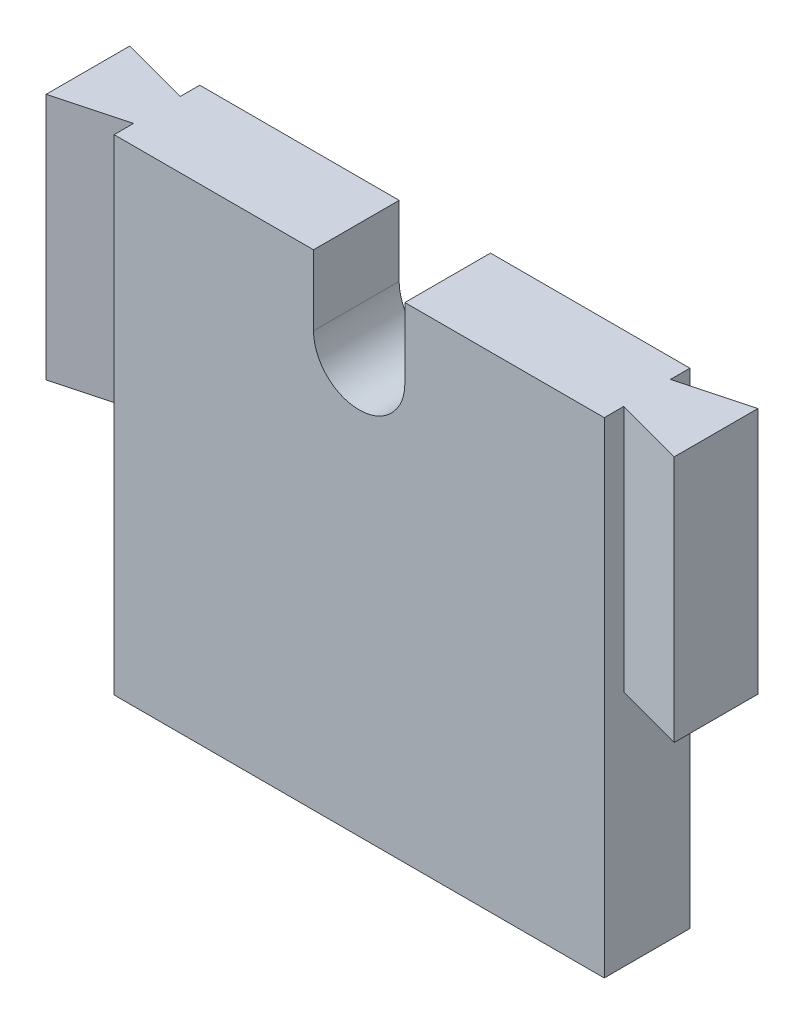
ISO-10303-21;
HEADER;
FILE_DESCRIPTION(('STEP AP214'),'2;1');
FILE_NAME('part.step','',(''),(''),'','','');
FILE_SCHEMA(('AUTOMOTIVE_DESIGN { 1 0 10303 214 1 1 1 1 }'));
ENDSEC;
DATA;
#1=APPLICATION_CONTEXT('core data for automotive mechanical design processes');
#2=APPLICATION_PROTOCOL_DEFINITION('international standard','automotive_design',2000,#1);
#3=PRODUCT_CONTEXT('',#1,'mechanical');
#4=PRODUCT('Part','Part','',(#3));
#5=PRODUCT_RELATED_PRODUCT_CATEGORY('part','',(#4));
#6=PRODUCT_DEFINITION_FORMATION('','',#4);
#7=PRODUCT_DEFINITION_CONTEXT('part definition',#1,'design');
#8=PRODUCT_DEFINITION('design','',#6,#7);
#9=PRODUCT_DEFINITION_SHAPE('','',#8);
#10=(LENGTH_UNIT() NAMED_UNIT(*) SI_UNIT(.MILLI.,.METRE.));
#11=(NAMED_UNIT(*) PLANE_ANGLE_UNIT() SI_UNIT($,.RADIAN.));
#12=(NAMED_UNIT(*) SI_UNIT($,.STERADIAN.) SOLID_ANGLE_UNIT());
#13=UNCERTAINTY_MEASURE_WITH_UNIT(LENGTH_MEASURE(1.E-05),#10,'distance_accuracy_value','');
#14=(GEOMETRIC_REPRESENTATION_CONTEXT(3) GLOBAL_UNCERTAINTY_ASSIGNED_CONTEXT((#13)) GLOBAL_UNIT_ASSIGNED_CONTEXT((#10,
#11,#12)) REPRESENTATION_CONTEXT('',''));
#15=CARTESIAN_POINT('',(0.,0.,0.));
#16=DIRECTION('',(0.,0.,1.));
#17=DIRECTION('',(1.,0.,0.));
#18=AXIS2_PLACEMENT_3D('',#15,#16,#17);
#19=CARTESIAN_POINT('',(-38.3529411764706,0.,9.));
#20=DIRECTION('',(1.,0.,0.));
#21=DIRECTION('',(0.,0.,-1.));
#22=AXIS2_PLACEMENT_3D('',#19,#20,#21);
#23=PLANE('',#22);
#24=DIRECTION('',(0.,0.,-1.));
#25=VECTOR('',#24,1.);
#26=CARTESIAN_POINT('',(-38.3529411764706,0.411764705882348,9.));
#27=LINE('',#26,#25);
#28=CARTESIAN_POINT('',(-38.3529411764706,0.411764705882348,8.89114283826888));
#29=VERTEX_POINT('',#28);
#30=CARTESIAN_POINT('',(-38.3529411764706,0.411764705882348,0.108857161731066));
#31=VERTEX_POINT('',#30);
#32=EDGE_CURVE('E302',#29,#31,#27,.T.);
#33=ORIENTED_EDGE('',*,*,#32,.F.);
#34=DIRECTION('',(0.,1.,0.));
#35=VECTOR('',#34,1.);
#36=CARTESIAN_POINT('',(-38.3529411764706,0.,8.89114283826888));
#37=LINE('',#36,#35);
#38=CARTESIAN_POINT('',(-38.3529411764706,26.4117647058823,8.89114283826888));
#39=VERTEX_POINT('',#38);
#40=EDGE_CURVE('E296',#29,#39,#37,.T.);
#41=ORIENTED_EDGE('',*,*,#40,.T.);
#42=DIRECTION('',(0.,0.,-1.));
#43=VECTOR('',#42,1.);
#44=CARTESIAN_POINT('',(-38.3529411764706,26.4117647058823,9.));
#45=LINE('',#44,#43);
#46=CARTESIAN_POINT('',(-38.3529411764706,26.4117647058823,0.108857161731066));
#47=VERTEX_POINT('',#46);
#48=EDGE_CURVE('E254',#39,#47,#45,.T.);
#49=ORIENTED_EDGE('',*,*,#48,.T.);
#50=DIRECTION('',(0.,-1.,0.));
#51=VECTOR('',#50,1.);
#52=CARTESIAN_POINT('',(-38.3529411764706,0.,0.108857161731066));
#53=LINE('',#52,#51);
#54=EDGE_CURVE('E53',#47,#31,#53,.T.);
#55=ORIENTED_EDGE('',*,*,#54,.T.);
#56=EDGE_LOOP('',(#33,#41,#49,#55));
#57=FACE_BOUND('',#56,.T.);
#58=ADVANCED_FACE('F44',(#57),#23,.F.);
#59=CARTESIAN_POINT('',(-38.7592016348187,-24.5882352941177,0.));
#60=DIRECTION('',(-0.258819045102525,0.,0.965925826289067));
#61=DIRECTION('',(0.965925826289067,0.,0.258819045102525));
#62=AXIS2_PLACEMENT_3D('',#59,#60,#61);
#63=PLANE('',#62);
#64=DIRECTION('',(0.965925826289067,0.,0.258819045102525));
#65=VECTOR('',#64,1.);
#66=CARTESIAN_POINT('',(-38.7592016348187,0.411764705882348,0.));
#67=LINE('',#66,#65);
#68=CARTESIAN_POINT('',(-31.1084974793026,0.411764705882348,2.05));
#69=VERTEX_POINT('',#68);
#70=EDGE_CURVE('E311',#31,#69,#67,.T.);
#71=ORIENTED_EDGE('',*,*,#70,.F.);
#72=ORIENTED_EDGE('',*,*,#54,.F.);
#73=DIRECTION('',(0.965925826289067,0.,0.258819045102525));
#74=VECTOR('',#73,1.);
#75=CARTESIAN_POINT('',(-38.7592016348187,26.4117647058823,0.));
#76=LINE('',#75,#74);
#77=CARTESIAN_POINT('',(-31.1084974793026,26.4117647058823,2.05));
#78=VERTEX_POINT('',#77);
#79=EDGE_CURVE('E184',#47,#78,#76,.T.);
#80=ORIENTED_EDGE('',*,*,#79,.T.);
#81=DIRECTION('',(0.,1.,0.));
#82=VECTOR('',#81,1.);
#83=CARTESIAN_POINT('',(-31.1084974793026,-24.5882352941177,2.05));
#84=LINE('',#83,#82);
#85=EDGE_CURVE('E195',#69,#78,#84,.T.);
#86=ORIENTED_EDGE('',*,*,#85,.F.);
#87=EDGE_LOOP('',(#71,#72,#80,#86));
#88=FACE_BOUND('',#87,.T.);
#89=ADVANCED_FACE('F308',(#88),#63,.F.);
#90=CARTESIAN_POINT('',(-38.7592016348189,-24.5882352941177,9.));
#91=DIRECTION('',(-0.258819045102518,0.,-0.965925826289069));
#92=DIRECTION('',(-0.965925826289069,0.,0.258819045102518));
#93=AXIS2_PLACEMENT_3D('',#90,#91,#92);
#94=PLANE('',#93);
#95=DIRECTION('',(-0.965925826289069,0.,0.258819045102518));
#96=VECTOR('',#95,1.);
#97=CARTESIAN_POINT('',(-38.7592016348189,0.411764705882348,9.));
#98=LINE('',#97,#96);
#99=CARTESIAN_POINT('',(-31.1084974793026,0.411764705882348,6.95));
#100=VERTEX_POINT('',#99);
#101=EDGE_CURVE('E329',#100,#29,#98,.T.);
#102=ORIENTED_EDGE('',*,*,#101,.F.);
#103=DIRECTION('',(0.,1.,0.));
#104=VECTOR('',#103,1.);
#105=CARTESIAN_POINT('',(-31.1084974793026,-24.5882352941177,6.95));
#106=LINE('',#105,#104);
#107=CARTESIAN_POINT('',(-31.1084974793026,26.4117647058823,6.95));
#108=VERTEX_POINT('',#107);
#109=EDGE_CURVE('E320',#100,#108,#106,.T.);
#110=ORIENTED_EDGE('',*,*,#109,.T.);
#111=DIRECTION('',(-0.965925826289069,0.,0.258819045102518));
#112=VECTOR('',#111,1.);
#113=CARTESIAN_POINT('',(-38.7592016348189,26.4117647058823,9.));
#114=LINE('',#113,#112);
#115=EDGE_CURVE('E339',#108,#39,#114,.T.);
#116=ORIENTED_EDGE('',*,*,#115,.T.);
#117=ORIENTED_EDGE('',*,*,#40,.F.);
#118=EDGE_LOOP('',(#102,#110,#116,#117));
#119=FACE_BOUND('',#118,.T.);
#120=ADVANCED_FACE('F397',(#119),#94,.F.);
#121=CARTESIAN_POINT('',(0.,-24.5882352941177,9.));
#122=DIRECTION('',(0.,1.,0.));
#123=DIRECTION('',(-1.,0.,0.));
#124=AXIS2_PLACEMENT_3D('',#121,#122,#123);
#125=PLANE('',#124);
#126=DIRECTION('',(1.,0.,0.));
#127=VECTOR('',#126,1.);
#128=CARTESIAN_POINT('',(0.,-24.5882352941177,9.));
#129=LINE('',#128,#127);
#130=CARTESIAN_POINT('',(-31.1084974793026,-24.5882352941177,9.));
#131=VERTEX_POINT('',#130);
#132=CARTESIAN_POINT('',(20.4026151263614,-24.5882352941177,9.));
#133=VERTEX_POINT('',#132);
#134=EDGE_CURVE('E230',#131,#133,#129,.T.);
#135=ORIENTED_EDGE('',*,*,#134,.F.);
#136=DIRECTION('',(0.,0.,-1.));
#137=VECTOR('',#136,1.);
#138=CARTESIAN_POINT('',(-31.1084974793026,-24.5882352941177,2.05));
#139=LINE('',#138,#137);
#140=CARTESIAN_POINT('',(-31.1084974793026,-24.5882352941177,0.));
#141=VERTEX_POINT('',#140);
#142=EDGE_CURVE('E198',#131,#141,#139,.T.);
#143=ORIENTED_EDGE('',*,*,#142,.T.);
#144=DIRECTION('',(1.,0.,0.));
#145=VECTOR('',#144,1.);
#146=CARTESIAN_POINT('',(0.,-24.5882352941177,0.));
#147=LINE('',#146,#145);
#148=CARTESIAN_POINT('',(20.4026151263614,-24.5882352941176,0.));
#149=VERTEX_POINT('',#148);
#150=EDGE_CURVE('E229',#141,#149,#147,.T.);
#151=ORIENTED_EDGE('',*,*,#150,.T.);
#152=DIRECTION('',(0.,0.,1.));
#153=VECTOR('',#152,1.);
#154=CARTESIAN_POINT('',(20.4026151263614,-24.5882352941177,6.95));
#155=LINE('',#154,#153);
#156=EDGE_CURVE('E176',#149,#133,#155,.T.);
#157=ORIENTED_EDGE('',*,*,#156,.T.);
#158=EDGE_LOOP('',(#135,#143,#151,#157));
#159=FACE_BOUND('',#158,.T.);
#160=ADVANCED_FACE('F46',(#159),#125,.F.);
#161=CARTESIAN_POINT('',(27.6470588235294,0.,9.));
#162=DIRECTION('',(1.,0.,0.));
#163=DIRECTION('',(0.,1.,0.));
#164=AXIS2_PLACEMENT_3D('',#161,#162,#163);
#165=PLANE('',#164);
#166=DIRECTION('',(0.,0.,1.));
#167=VECTOR('',#166,1.);
#168=CARTESIAN_POINT('',(27.6470588235294,0.411764705882355,9.));
#169=LINE('',#168,#167);
#170=CARTESIAN_POINT('',(27.6470588235294,0.411764705882355,0.108857161731061));
#171=VERTEX_POINT('',#170);
#172=CARTESIAN_POINT('',(27.6470588235294,0.411764705882355,8.89114283826888));
#173=VERTEX_POINT('',#172);
#174=EDGE_CURVE('E68',#171,#173,#169,.T.);
#175=ORIENTED_EDGE('',*,*,#174,.F.);
#176=DIRECTION('',(0.,-1.,0.));
#177=VECTOR('',#176,1.);
#178=CARTESIAN_POINT('',(27.6470588235294,0.,0.108857161731063));
#179=LINE('',#178,#177);
#180=CARTESIAN_POINT('',(27.6470588235294,26.4117647058823,0.108857161731062));
#181=VERTEX_POINT('',#180);
#182=EDGE_CURVE('E220',#181,#171,#179,.T.);
#183=ORIENTED_EDGE('',*,*,#182,.F.);
#184=DIRECTION('',(0.,0.,-1.));
#185=VECTOR('',#184,1.);
#186=CARTESIAN_POINT('',(27.6470588235294,26.4117647058824,9.));
#187=LINE('',#186,#185);
#188=CARTESIAN_POINT('',(27.6470588235294,26.4117647058823,8.89114283826888));
#189=VERTEX_POINT('',#188);
#190=EDGE_CURVE('E292',#189,#181,#187,.T.);
#191=ORIENTED_EDGE('',*,*,#190,.F.);
#192=DIRECTION('',(0.,1.,0.));
#193=VECTOR('',#192,1.);
#194=CARTESIAN_POINT('',(27.6470588235294,0.,8.89114283826888));
#195=LINE('',#194,#193);
#196=EDGE_CURVE('E226',#173,#189,#195,.T.);
#197=ORIENTED_EDGE('',*,*,#196,.F.);
#198=EDGE_LOOP('',(#175,#183,#191,#197));
#199=FACE_BOUND('',#198,.T.);
#200=ADVANCED_FACE('F378',(#199),#165,.T.);
#201=CARTESIAN_POINT('',(0.,26.4117647058823,9.));
#202=DIRECTION('',(0.,1.,0.));
#203=DIRECTION('',(-1.,0.,0.));
#204=AXIS2_PLACEMENT_3D('',#201,#202,#203);
#205=PLANE('',#204);
#206=DIRECTION('',(0.,0.,1.));
#207=VECTOR('',#206,1.);
#208=CARTESIAN_POINT('',(20.4026151263614,26.4117647058823,6.95));
#209=LINE('',#208,#207);
#210=CARTESIAN_POINT('',(20.4026151263614,26.4117647058823,6.95));
#211=VERTEX_POINT('',#210);
#212=CARTESIAN_POINT('',(20.4026151263614,26.4117647058824,9.));
#213=VERTEX_POINT('',#212);
#214=EDGE_CURVE('E182',#211,#213,#209,.T.);
#215=ORIENTED_EDGE('',*,*,#214,.F.);
#216=DIRECTION('',(-0.965925826289069,0.,-0.258819045102518));
#217=VECTOR('',#216,1.);
#218=CARTESIAN_POINT('',(28.0533192818777,26.4117647058823,9.));
#219=LINE('',#218,#217);
#220=EDGE_CURVE('E173',#189,#211,#219,.T.);
#221=ORIENTED_EDGE('',*,*,#220,.F.);
#222=ORIENTED_EDGE('',*,*,#190,.T.);
#223=DIRECTION('',(0.965925826289067,0.,-0.258819045102525));
#224=VECTOR('',#223,1.);
#225=CARTESIAN_POINT('',(28.0533192818775,26.4117647058823,0.));
#226=LINE('',#225,#224);
#227=CARTESIAN_POINT('',(20.4026151263614,26.4117647058823,2.05));
#228=VERTEX_POINT('',#227);
#229=EDGE_CURVE('E214',#228,#181,#226,.T.);
#230=ORIENTED_EDGE('',*,*,#229,.F.);
#231=DIRECTION('',(0.,0.,1.));
#232=VECTOR('',#231,1.);
#233=CARTESIAN_POINT('',(20.4026151263614,26.4117647058823,2.05));
#234=LINE('',#233,#232);
#235=CARTESIAN_POINT('',(20.4026151263614,26.4117647058823,0.));
#236=VERTEX_POINT('',#235);
#237=EDGE_CURVE('E193',#236,#228,#234,.T.);
#238=ORIENTED_EDGE('',*,*,#237,.F.);
#239=DIRECTION('',(1.,0.,0.));
#240=VECTOR('',#239,1.);
#241=CARTESIAN_POINT('',(0.,26.4117647058823,0.));
#242=LINE('',#241,#240);
#243=CARTESIAN_POINT('',(-0.552941176470589,26.4117647058823,0.));
#244=VERTEX_POINT('',#243);
#245=EDGE_CURVE('E258',#244,#236,#242,.T.);
#246=ORIENTED_EDGE('',*,*,#245,.F.);
#247=DIRECTION('',(0.,0.,-1.));
#248=VECTOR('',#247,1.);
#249=CARTESIAN_POINT('',(-0.552941176470589,26.4117647058823,9.));
#250=LINE('',#249,#248);
#251=CARTESIAN_POINT('',(-0.552941176470589,26.4117647058823,9.));
#252=VERTEX_POINT('',#251);
#253=EDGE_CURVE('E289',#252,#244,#250,.T.);
#254=ORIENTED_EDGE('',*,*,#253,.F.);
#255=DIRECTION('',(1.,0.,0.));
#256=VECTOR('',#255,1.);
#257=CARTESIAN_POINT('',(0.,26.4117647058823,9.));
#258=LINE('',#257,#256);
#259=EDGE_CURVE('E234',#252,#213,#258,.T.);
#260=ORIENTED_EDGE('',*,*,#259,.T.);
#261=EDGE_LOOP('',(#215,#221,#222,#230,#238,#246,#254,#260));
#262=FACE_BOUND('',#261,.T.);
#263=ADVANCED_FACE('F371',(#262),#205,.T.);
#264=CARTESIAN_POINT('',(-0.552941176470589,0.,9.));
#265=DIRECTION('',(-1.,0.,0.));
#266=DIRECTION('',(0.,0.,1.));
#267=AXIS2_PLACEMENT_3D('',#264,#265,#266);
#268=PLANE('',#267);
#269=DIRECTION('',(0.,1.,0.));
#270=VECTOR('',#269,1.);
#271=CARTESIAN_POINT('',(-0.552941176470589,0.,0.));
#272=LINE('',#271,#270);
#273=CARTESIAN_POINT('',(-0.552941176470589,19.0367647058823,0.));
#274=VERTEX_POINT('',#273);
#275=EDGE_CURVE('E262',#274,#244,#272,.T.);
#276=ORIENTED_EDGE('',*,*,#275,.F.);
#277=DIRECTION('',(0.,0.,-1.));
#278=VECTOR('',#277,1.);
#279=CARTESIAN_POINT('',(-0.552941176470589,19.0367647058823,9.));
#280=LINE('',#279,#278);
#281=CARTESIAN_POINT('',(-0.552941176470589,19.0367647058823,9.));
#282=VERTEX_POINT('',#281);
#283=EDGE_CURVE('E286',#282,#274,#280,.T.);
#284=ORIENTED_EDGE('',*,*,#283,.F.);
#285=DIRECTION('',(0.,1.,0.));
#286=VECTOR('',#285,1.);
#287=CARTESIAN_POINT('',(-0.552941176470589,0.,9.));
#288=LINE('',#287,#286);
#289=EDGE_CURVE('E239',#282,#252,#288,.T.);
#290=ORIENTED_EDGE('',*,*,#289,.T.);
#291=ORIENTED_EDGE('',*,*,#253,.T.);
#292=EDGE_LOOP('',(#276,#284,#290,#291));
#293=FACE_BOUND('',#292,.T.);
#294=ADVANCED_FACE('F366',(#293),#268,.T.);
#295=CARTESIAN_POINT('',(-5.35294117647059,19.0367647058823,9.));
#296=DIRECTION('',(0.,0.,-1.));
#297=DIRECTION('',(-1.,0.,0.));
#298=AXIS2_PLACEMENT_3D('',#295,#296,#297);
#299=CYLINDRICAL_SURFACE('',#298,4.8);
#300=CARTESIAN_POINT('',(-5.35294117647059,19.0367647058823,0.));
#301=DIRECTION('',(0.,0.,1.));
#302=DIRECTION('',(1.,0.,0.));
#303=AXIS2_PLACEMENT_3D('',#300,#301,#302);
#304=CIRCLE('',#303,4.8);
#305=CARTESIAN_POINT('',(-10.1529411764706,19.0367647058823,0.));
#306=VERTEX_POINT('',#305);
#307=EDGE_CURVE('E266',#306,#274,#304,.T.);
#308=ORIENTED_EDGE('',*,*,#307,.F.);
#309=DIRECTION('',(0.,0.,-1.));
#310=VECTOR('',#309,1.);
#311=CARTESIAN_POINT('',(-10.1529411764706,19.0367647058823,9.));
#312=LINE('',#311,#310);
#313=CARTESIAN_POINT('',(-10.1529411764706,19.0367647058823,9.));
#314=VERTEX_POINT('',#313);
#315=EDGE_CURVE('E283',#314,#306,#312,.T.);
#316=ORIENTED_EDGE('',*,*,#315,.F.);
#317=CARTESIAN_POINT('',(-5.35294117647059,19.0367647058823,9.));
#318=DIRECTION('',(0.,0.,1.));
#319=DIRECTION('',(1.,0.,0.));
#320=AXIS2_PLACEMENT_3D('',#317,#318,#319);
#321=CIRCLE('',#320,4.8);
#322=EDGE_CURVE('E243',#314,#282,#321,.T.);
#323=ORIENTED_EDGE('',*,*,#322,.T.);
#324=ORIENTED_EDGE('',*,*,#283,.T.);
#325=EDGE_LOOP('',(#308,#316,#323,#324));
#326=FACE_BOUND('',#325,.T.);
#327=ADVANCED_FACE('F363',(#326),#299,.F.);
#328=CARTESIAN_POINT('',(-10.1529411764706,0.,9.));
#329=DIRECTION('',(-1.,0.,0.));
#330=DIRECTION('',(0.,-1.,0.));
#331=AXIS2_PLACEMENT_3D('',#328,#329,#330);
#332=PLANE('',#331);
#333=DIRECTION('',(0.,1.,0.));
#334=VECTOR('',#333,1.);
#335=CARTESIAN_POINT('',(-10.1529411764706,0.,0.));
#336=LINE('',#335,#334);
#337=CARTESIAN_POINT('',(-10.1529411764706,26.4117647058823,0.));
#338=VERTEX_POINT('',#337);
#339=EDGE_CURVE('E270',#306,#338,#336,.T.);
#340=ORIENTED_EDGE('',*,*,#339,.T.);
#341=DIRECTION('',(0.,0.,-1.));
#342=VECTOR('',#341,1.);
#343=CARTESIAN_POINT('',(-10.1529411764706,26.4117647058823,9.));
#344=LINE('',#343,#342);
#345=CARTESIAN_POINT('',(-10.1529411764706,26.4117647058823,9.));
#346=VERTEX_POINT('',#345);
#347=EDGE_CURVE('E279',#346,#338,#344,.T.);
#348=ORIENTED_EDGE('',*,*,#347,.F.);
#349=DIRECTION('',(0.,1.,0.));
#350=VECTOR('',#349,1.);
#351=CARTESIAN_POINT('',(-10.1529411764706,0.,9.));
#352=LINE('',#351,#350);
#353=EDGE_CURVE('E247',#314,#346,#352,.T.);
#354=ORIENTED_EDGE('',*,*,#353,.F.);
#355=ORIENTED_EDGE('',*,*,#315,.T.);
#356=EDGE_LOOP('',(#340,#348,#354,#355));
#357=FACE_BOUND('',#356,.T.);
#358=ADVANCED_FACE('F356',(#357),#332,.F.);
#359=CARTESIAN_POINT('',(0.,26.4117647058823,9.));
#360=DIRECTION('',(0.,1.,0.));
#361=DIRECTION('',(-1.,0.,0.));
#362=AXIS2_PLACEMENT_3D('',#359,#360,#361);
#363=PLANE('',#362);
#364=DIRECTION('',(0.,0.,-1.));
#365=VECTOR('',#364,1.);
#366=CARTESIAN_POINT('',(-31.1084974793026,26.4117647058823,2.05));
#367=LINE('',#366,#365);
#368=CARTESIAN_POINT('',(-31.1084974793026,26.4117647058823,0.));
#369=VERTEX_POINT('',#368);
#370=EDGE_CURVE('E202',#78,#369,#367,.T.);
#371=ORIENTED_EDGE('',*,*,#370,.F.);
#372=ORIENTED_EDGE('',*,*,#79,.F.);
#373=ORIENTED_EDGE('',*,*,#48,.F.);
#374=ORIENTED_EDGE('',*,*,#115,.F.);
#375=DIRECTION('',(0.,0.,-1.));
#376=VECTOR('',#375,1.);
#377=CARTESIAN_POINT('',(-31.1084974793026,26.4117647058823,6.95));
#378=LINE('',#377,#376);
#379=CARTESIAN_POINT('',(-31.1084974793026,26.4117647058823,9.));
#380=VERTEX_POINT('',#379);
#381=EDGE_CURVE('E187',#380,#108,#378,.T.);
#382=ORIENTED_EDGE('',*,*,#381,.F.);
#383=DIRECTION('',(1.,0.,0.));
#384=VECTOR('',#383,1.);
#385=CARTESIAN_POINT('',(0.,26.4117647058823,9.));
#386=LINE('',#385,#384);
#387=EDGE_CURVE('E251',#380,#346,#386,.T.);
#388=ORIENTED_EDGE('',*,*,#387,.T.);
#389=ORIENTED_EDGE('',*,*,#347,.T.);
#390=DIRECTION('',(1.,0.,0.));
#391=VECTOR('',#390,1.);
#392=CARTESIAN_POINT('',(0.,26.4117647058823,0.));
#393=LINE('',#392,#391);
#394=EDGE_CURVE('E235',#369,#338,#393,.T.);
#395=ORIENTED_EDGE('',*,*,#394,.F.);
#396=EDGE_LOOP('',(#371,#372,#373,#374,#382,#388,#389,#395));
#397=FACE_BOUND('',#396,.T.);
#398=ADVANCED_FACE('F313',(#397),#363,.T.);
#399=CARTESIAN_POINT('',(0.,0.,9.));
#400=DIRECTION('',(0.,0.,1.));
#401=DIRECTION('',(1.,0.,0.));
#402=AXIS2_PLACEMENT_3D('',#399,#400,#401);
#403=PLANE('',#402);
#404=DIRECTION('',(0.,1.,0.));
#405=VECTOR('',#404,1.);
#406=CARTESIAN_POINT('',(20.4026151263614,-24.5882352941177,9.));
#407=LINE('',#406,#405);
#408=EDGE_CURVE('E177',#133,#213,#407,.T.);
#409=ORIENTED_EDGE('',*,*,#408,.T.);
#410=ORIENTED_EDGE('',*,*,#259,.F.);
#411=ORIENTED_EDGE('',*,*,#289,.F.);
#412=ORIENTED_EDGE('',*,*,#322,.F.);
#413=ORIENTED_EDGE('',*,*,#353,.T.);
#414=ORIENTED_EDGE('',*,*,#387,.F.);
#415=DIRECTION('',(0.,1.,0.));
#416=VECTOR('',#415,1.);
#417=CARTESIAN_POINT('',(-31.1084974793026,-24.5882352941177,9.));
#418=LINE('',#417,#416);
#419=EDGE_CURVE('E336',#131,#380,#418,.T.);
#420=ORIENTED_EDGE('',*,*,#419,.F.);
#421=ORIENTED_EDGE('',*,*,#134,.T.);
#422=EDGE_LOOP('',(#409,#410,#411,#412,#413,#414,#420,#421));
#423=FACE_BOUND('',#422,.T.);
#424=ADVANCED_FACE('F349',(#423),#403,.T.);
#425=CARTESIAN_POINT('',(0.,0.,0.));
#426=DIRECTION('',(0.,0.,1.));
#427=DIRECTION('',(1.,0.,0.));
#428=AXIS2_PLACEMENT_3D('',#425,#426,#427);
#429=PLANE('',#428);
#430=ORIENTED_EDGE('',*,*,#150,.F.);
#431=DIRECTION('',(0.,1.,0.));
#432=VECTOR('',#431,1.);
#433=CARTESIAN_POINT('',(-31.1084974793026,-24.5882352941177,0.));
#434=LINE('',#433,#432);
#435=EDGE_CURVE('E199',#141,#369,#434,.T.);
#436=ORIENTED_EDGE('',*,*,#435,.T.);
#437=ORIENTED_EDGE('',*,*,#394,.T.);
#438=ORIENTED_EDGE('',*,*,#339,.F.);
#439=ORIENTED_EDGE('',*,*,#307,.T.);
#440=ORIENTED_EDGE('',*,*,#275,.T.);
#441=ORIENTED_EDGE('',*,*,#245,.T.);
#442=DIRECTION('',(0.,1.,0.));
#443=VECTOR('',#442,1.);
#444=CARTESIAN_POINT('',(20.4026151263614,-24.5882352941177,0.));
#445=LINE('',#444,#443);
#446=EDGE_CURVE('E217',#149,#236,#445,.T.);
#447=ORIENTED_EDGE('',*,*,#446,.F.);
#448=EDGE_LOOP('',(#430,#436,#437,#438,#439,#440,#441,#447));
#449=FACE_BOUND('',#448,.T.);
#450=ADVANCED_FACE('F361',(#449),#429,.F.);
#451=CARTESIAN_POINT('',(28.0533192818775,-24.5882352941177,0.));
#452=DIRECTION('',(0.258819045102525,0.,0.965925826289067));
#453=DIRECTION('',(0.965925826289067,0.,-0.258819045102525));
#454=AXIS2_PLACEMENT_3D('',#451,#452,#453);
#455=PLANE('',#454);
#456=ORIENTED_EDGE('',*,*,#182,.T.);
#457=DIRECTION('',(-0.965925826289067,0.,0.258819045102525));
#458=VECTOR('',#457,1.);
#459=CARTESIAN_POINT('',(28.0533192818775,0.411764705882355,0.));
#460=LINE('',#459,#458);
#461=CARTESIAN_POINT('',(20.4026151263614,0.411764705882355,2.05));
#462=VERTEX_POINT('',#461);
#463=EDGE_CURVE('E324',#171,#462,#460,.T.);
#464=ORIENTED_EDGE('',*,*,#463,.T.);
#465=DIRECTION('',(0.,1.,0.));
#466=VECTOR('',#465,1.);
#467=CARTESIAN_POINT('',(20.4026151263614,-24.5882352941177,2.05));
#468=LINE('',#467,#466);
#469=EDGE_CURVE('E168',#462,#228,#468,.T.);
#470=ORIENTED_EDGE('',*,*,#469,.T.);
#471=ORIENTED_EDGE('',*,*,#229,.T.);
#472=EDGE_LOOP('',(#456,#464,#470,#471));
#473=FACE_BOUND('',#472,.T.);
#474=ADVANCED_FACE('F380',(#473),#455,.F.);
#475=CARTESIAN_POINT('',(-31.1084974793026,-24.5882352941177,2.05));
#476=DIRECTION('',(1.,0.,0.));
#477=DIRECTION('',(0.,0.,-1.));
#478=AXIS2_PLACEMENT_3D('',#475,#476,#477);
#479=PLANE('',#478);
#480=ORIENTED_EDGE('',*,*,#142,.F.);
#481=ORIENTED_EDGE('',*,*,#419,.T.);
#482=ORIENTED_EDGE('',*,*,#381,.T.);
#483=ORIENTED_EDGE('',*,*,#109,.F.);
#484=DIRECTION('',(0.,0.,1.));
#485=VECTOR('',#484,1.);
#486=CARTESIAN_POINT('',(-31.1084974793026,0.411764705882348,0.));
#487=LINE('',#486,#485);
#488=EDGE_CURVE('E60',#69,#100,#487,.T.);
#489=ORIENTED_EDGE('',*,*,#488,.F.);
#490=ORIENTED_EDGE('',*,*,#85,.T.);
#491=ORIENTED_EDGE('',*,*,#370,.T.);
#492=ORIENTED_EDGE('',*,*,#435,.F.);
#493=EDGE_LOOP('',(#480,#481,#482,#483,#489,#490,#491,#492));
#494=FACE_BOUND('',#493,.T.);
#495=ADVANCED_FACE('F317',(#494),#479,.F.);
#496=CARTESIAN_POINT('',(20.4026151263614,-24.5882352941177,6.95));
#497=DIRECTION('',(-1.,0.,0.));
#498=DIRECTION('',(0.,0.,1.));
#499=AXIS2_PLACEMENT_3D('',#496,#497,#498);
#500=PLANE('',#499);
#501=ORIENTED_EDGE('',*,*,#214,.T.);
#502=ORIENTED_EDGE('',*,*,#408,.F.);
#503=ORIENTED_EDGE('',*,*,#156,.F.);
#504=ORIENTED_EDGE('',*,*,#446,.T.);
#505=ORIENTED_EDGE('',*,*,#237,.T.);
#506=ORIENTED_EDGE('',*,*,#469,.F.);
#507=DIRECTION('',(0.,0.,-1.));
#508=VECTOR('',#507,1.);
#509=CARTESIAN_POINT('',(20.4026151263614,0.411764705882355,0.));
#510=LINE('',#509,#508);
#511=CARTESIAN_POINT('',(20.4026151263614,0.411764705882355,6.95));
#512=VERTEX_POINT('',#511);
#513=EDGE_CURVE('E156',#512,#462,#510,.T.);
#514=ORIENTED_EDGE('',*,*,#513,.F.);
#515=DIRECTION('',(0.,1.,0.));
#516=VECTOR('',#515,1.);
#517=CARTESIAN_POINT('',(20.4026151263614,-24.5882352941177,6.95));
#518=LINE('',#517,#516);
#519=EDGE_CURVE('E165',#512,#211,#518,.T.);
#520=ORIENTED_EDGE('',*,*,#519,.T.);
#521=EDGE_LOOP('',(#501,#502,#503,#504,#505,#506,#514,#520));
#522=FACE_BOUND('',#521,.T.);
#523=ADVANCED_FACE('F164',(#522),#500,.F.);
#524=CARTESIAN_POINT('',(28.0533192818777,-24.5882352941177,9.));
#525=DIRECTION('',(0.258819045102518,0.,-0.965925826289069));
#526=DIRECTION('',(-0.965925826289069,0.,-0.258819045102518));
#527=AXIS2_PLACEMENT_3D('',#524,#525,#526);
#528=PLANE('',#527);
#529=ORIENTED_EDGE('',*,*,#519,.F.);
#530=DIRECTION('',(0.965925826289069,0.,0.258819045102518));
#531=VECTOR('',#530,1.);
#532=CARTESIAN_POINT('',(28.0533192818777,0.411764705882355,9.));
#533=LINE('',#532,#531);
#534=EDGE_CURVE('E11',#512,#173,#533,.T.);
#535=ORIENTED_EDGE('',*,*,#534,.T.);
#536=ORIENTED_EDGE('',*,*,#196,.T.);
#537=ORIENTED_EDGE('',*,*,#220,.T.);
#538=EDGE_LOOP('',(#529,#535,#536,#537));
#539=FACE_BOUND('',#538,.T.);
#540=ADVANCED_FACE('F171',(#539),#528,.F.);
#541=CARTESIAN_POINT('',(0.,0.411764705882355,0.));
#542=DIRECTION('',(0.,1.,0.));
#543=DIRECTION('',(0.,0.,1.));
#544=AXIS2_PLACEMENT_3D('',#541,#542,#543);
#545=PLANE('',#544);
#546=ORIENTED_EDGE('',*,*,#174,.T.);
#547=ORIENTED_EDGE('',*,*,#534,.F.);
#548=ORIENTED_EDGE('',*,*,#513,.T.);
#549=ORIENTED_EDGE('',*,*,#463,.F.);
#550=EDGE_LOOP('',(#546,#547,#548,#549));
#551=FACE_BOUND('',#550,.T.);
#552=ADVANCED_FACE('F155',(#551),#545,.F.);
#553=CARTESIAN_POINT('',(0.,0.411764705882348,0.));
#554=DIRECTION('',(0.,-1.,0.));
#555=DIRECTION('',(0.,0.,-1.));
#556=AXIS2_PLACEMENT_3D('',#553,#554,#555);
#557=PLANE('',#556);
#558=ORIENTED_EDGE('',*,*,#70,.T.);
#559=ORIENTED_EDGE('',*,*,#488,.T.);
#560=ORIENTED_EDGE('',*,*,#101,.T.);
#561=ORIENTED_EDGE('',*,*,#32,.T.);
#562=EDGE_LOOP('',(#558,#559,#560,#561));
#563=FACE_BOUND('',#562,.T.);
#564=ADVANCED_FACE('F436',(#563),#557,.T.);
#565=CLOSED_SHELL('',(#58,#89,#120,#160,#200,#263,#294,#327,#358,#398,#424,#450,#474,#495,#523,
#540,#552,#564));
#566=MANIFOLD_SOLID_BREP('B2',#565);
#567=ADVANCED_BREP_SHAPE_REPRESENTATION('',(#18,#566),#14);
#568=SHAPE_DEFINITION_REPRESENTATION(#9,#567);
ENDSEC;
END-ISO-10303-21;
